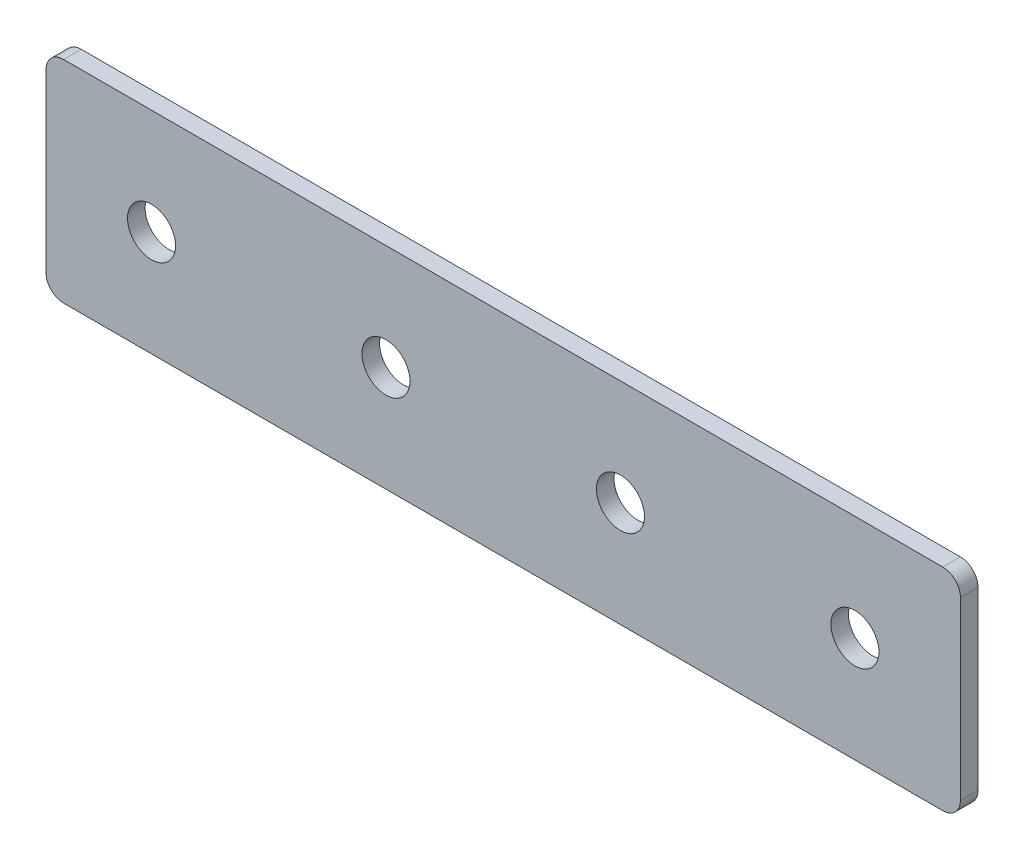
ISO-10303-21;
HEADER;
FILE_DESCRIPTION(('STEP AP214'),'2;1');
FILE_NAME('part.step','',(''),(''),'','','');
FILE_SCHEMA(('AUTOMOTIVE_DESIGN { 1 0 10303 214 1 1 1 1 }'));
ENDSEC;
DATA;
#1=APPLICATION_CONTEXT('core data for automotive mechanical design processes');
#2=APPLICATION_PROTOCOL_DEFINITION('international standard','automotive_design',2000,#1);
#3=PRODUCT_CONTEXT('',#1,'mechanical');
#4=PRODUCT('Part','Part','',(#3));
#5=PRODUCT_RELATED_PRODUCT_CATEGORY('part','',(#4));
#6=PRODUCT_DEFINITION_FORMATION('','',#4);
#7=PRODUCT_DEFINITION_CONTEXT('part definition',#1,'design');
#8=PRODUCT_DEFINITION('design','',#6,#7);
#9=PRODUCT_DEFINITION_SHAPE('','',#8);
#10=(LENGTH_UNIT() NAMED_UNIT(*) SI_UNIT(.MILLI.,.METRE.));
#11=(NAMED_UNIT(*) PLANE_ANGLE_UNIT() SI_UNIT($,.RADIAN.));
#12=(NAMED_UNIT(*) SI_UNIT($,.STERADIAN.) SOLID_ANGLE_UNIT());
#13=UNCERTAINTY_MEASURE_WITH_UNIT(LENGTH_MEASURE(1.E-05),#10,'distance_accuracy_value','');
#14=(GEOMETRIC_REPRESENTATION_CONTEXT(3) GLOBAL_UNCERTAINTY_ASSIGNED_CONTEXT((#13)) GLOBAL_UNIT_ASSIGNED_CONTEXT((#10,
#11,#12)) REPRESENTATION_CONTEXT('',''));
#15=CARTESIAN_POINT('',(0.,0.,0.));
#16=DIRECTION('',(0.,0.,1.));
#17=DIRECTION('',(1.,0.,0.));
#18=AXIS2_PLACEMENT_3D('',#15,#16,#17);
#19=CARTESIAN_POINT('',(0.,0.,3.));
#20=DIRECTION('',(0.,0.,-1.));
#21=DIRECTION('',(-1.,0.,0.));
#22=AXIS2_PLACEMENT_3D('',#19,#20,#21);
#23=PLANE('',#22);
#24=CARTESIAN_POINT('',(120.,0.,3.));
#25=DIRECTION('',(0.,0.,1.));
#26=DIRECTION('',(1.,0.,0.));
#27=AXIS2_PLACEMENT_3D('',#24,#25,#26);
#28=CIRCLE('',#27,4.1);
#29=CARTESIAN_POINT('',(124.1,0.,3.));
#30=VERTEX_POINT('',#29);
#31=EDGE_CURVE('E154',#30,#30,#28,.T.);
#32=ORIENTED_EDGE('',*,*,#31,.F.);
#33=EDGE_LOOP('',(#32));
#34=FACE_BOUND('',#33,.T.);
#35=CARTESIAN_POINT('',(80.,0.,3.));
#36=DIRECTION('',(0.,0.,1.));
#37=DIRECTION('',(1.,0.,0.));
#38=AXIS2_PLACEMENT_3D('',#35,#36,#37);
#39=CIRCLE('',#38,4.1);
#40=CARTESIAN_POINT('',(84.1,0.,3.));
#41=VERTEX_POINT('',#40);
#42=EDGE_CURVE('E160',#41,#41,#39,.T.);
#43=ORIENTED_EDGE('',*,*,#42,.F.);
#44=EDGE_LOOP('',(#43));
#45=FACE_BOUND('',#44,.T.);
#46=CARTESIAN_POINT('',(40.,0.,3.));
#47=DIRECTION('',(0.,0.,1.));
#48=DIRECTION('',(1.,0.,0.));
#49=AXIS2_PLACEMENT_3D('',#46,#47,#48);
#50=CIRCLE('',#49,4.1);
#51=CARTESIAN_POINT('',(44.1,0.,3.));
#52=VERTEX_POINT('',#51);
#53=EDGE_CURVE('E166',#52,#52,#50,.T.);
#54=ORIENTED_EDGE('',*,*,#53,.F.);
#55=EDGE_LOOP('',(#54));
#56=FACE_BOUND('',#55,.T.);
#57=CARTESIAN_POINT('',(0.,0.,3.));
#58=DIRECTION('',(0.,0.,1.));
#59=DIRECTION('',(1.,0.,0.));
#60=AXIS2_PLACEMENT_3D('',#57,#58,#59);
#61=CIRCLE('',#60,4.1);
#62=CARTESIAN_POINT('',(4.1,0.,3.));
#63=VERTEX_POINT('',#62);
#64=EDGE_CURVE('E107',#63,#63,#61,.T.);
#65=ORIENTED_EDGE('',*,*,#64,.F.);
#66=EDGE_LOOP('',(#65));
#67=FACE_BOUND('',#66,.T.);
#68=DIRECTION('',(1.,0.,0.));
#69=VECTOR('',#68,1.);
#70=CARTESIAN_POINT('',(-18.,-18.,3.));
#71=LINE('',#70,#69);
#72=CARTESIAN_POINT('',(-15.,-18.,3.));
#73=VERTEX_POINT('',#72);
#74=CARTESIAN_POINT('',(135.,-18.,3.));
#75=VERTEX_POINT('',#74);
#76=EDGE_CURVE('E84',#73,#75,#71,.T.);
#77=ORIENTED_EDGE('',*,*,#76,.T.);
#78=CARTESIAN_POINT('',(135.,-15.,3.));
#79=DIRECTION('',(0.,0.,-1.));
#80=DIRECTION('',(-1.,0.,0.));
#81=AXIS2_PLACEMENT_3D('',#78,#79,#80);
#82=CIRCLE('',#81,3.);
#83=CARTESIAN_POINT('',(138.,-15.,3.));
#84=VERTEX_POINT('',#83);
#85=EDGE_CURVE('E91',#75,#84,#82,.F.);
#86=ORIENTED_EDGE('',*,*,#85,.T.);
#87=DIRECTION('',(0.,1.,0.));
#88=VECTOR('',#87,1.);
#89=CARTESIAN_POINT('',(138.,-18.,3.));
#90=LINE('',#89,#88);
#91=CARTESIAN_POINT('',(138.,15.,3.));
#92=VERTEX_POINT('',#91);
#93=EDGE_CURVE('E102',#84,#92,#90,.T.);
#94=ORIENTED_EDGE('',*,*,#93,.T.);
#95=CARTESIAN_POINT('',(135.,15.,3.));
#96=DIRECTION('',(0.,0.,-1.));
#97=DIRECTION('',(-1.,0.,0.));
#98=AXIS2_PLACEMENT_3D('',#95,#96,#97);
#99=CIRCLE('',#98,3.);
#100=CARTESIAN_POINT('',(135.,18.,3.));
#101=VERTEX_POINT('',#100);
#102=EDGE_CURVE('E109',#92,#101,#99,.F.);
#103=ORIENTED_EDGE('',*,*,#102,.T.);
#104=DIRECTION('',(-1.,0.,0.));
#105=VECTOR('',#104,1.);
#106=CARTESIAN_POINT('',(138.,18.,3.));
#107=LINE('',#106,#105);
#108=CARTESIAN_POINT('',(-15.,18.,3.));
#109=VERTEX_POINT('',#108);
#110=EDGE_CURVE('E139',#101,#109,#107,.T.);
#111=ORIENTED_EDGE('',*,*,#110,.T.);
#112=CARTESIAN_POINT('',(-15.,15.,3.));
#113=DIRECTION('',(0.,0.,-1.));
#114=DIRECTION('',(-1.,0.,0.));
#115=AXIS2_PLACEMENT_3D('',#112,#113,#114);
#116=CIRCLE('',#115,3.);
#117=CARTESIAN_POINT('',(-18.,15.,3.));
#118=VERTEX_POINT('',#117);
#119=EDGE_CURVE('E92',#109,#118,#116,.F.);
#120=ORIENTED_EDGE('',*,*,#119,.T.);
#121=DIRECTION('',(0.,-1.,0.));
#122=VECTOR('',#121,1.);
#123=CARTESIAN_POINT('',(-18.,18.,3.));
#124=LINE('',#123,#122);
#125=CARTESIAN_POINT('',(-18.,-15.,3.));
#126=VERTEX_POINT('',#125);
#127=EDGE_CURVE('E86',#118,#126,#124,.T.);
#128=ORIENTED_EDGE('',*,*,#127,.T.);
#129=CARTESIAN_POINT('',(-15.,-15.,3.));
#130=DIRECTION('',(0.,0.,-1.));
#131=DIRECTION('',(-1.,0.,0.));
#132=AXIS2_PLACEMENT_3D('',#129,#130,#131);
#133=CIRCLE('',#132,3.);
#134=EDGE_CURVE('E82',#126,#73,#133,.F.);
#135=ORIENTED_EDGE('',*,*,#134,.T.);
#136=EDGE_LOOP('',(#77,#86,#94,#103,#111,#120,#128,#135));
#137=FACE_BOUND('',#136,.T.);
#138=ADVANCED_FACE('F16',(#34,#45,#56,#67,#137),#23,.F.);
#139=CARTESIAN_POINT('',(0.,0.,0.));
#140=DIRECTION('',(0.,0.,-1.));
#141=DIRECTION('',(-1.,0.,0.));
#142=AXIS2_PLACEMENT_3D('',#139,#140,#141);
#143=PLANE('',#142);
#144=CARTESIAN_POINT('',(120.,0.,0.));
#145=DIRECTION('',(0.,0.,1.));
#146=DIRECTION('',(1.,0.,0.));
#147=AXIS2_PLACEMENT_3D('',#144,#145,#146);
#148=CIRCLE('',#147,4.1);
#149=CARTESIAN_POINT('',(124.1,0.,0.));
#150=VERTEX_POINT('',#149);
#151=EDGE_CURVE('E150',#150,#150,#148,.T.);
#152=ORIENTED_EDGE('',*,*,#151,.T.);
#153=EDGE_LOOP('',(#152));
#154=FACE_BOUND('',#153,.T.);
#155=CARTESIAN_POINT('',(80.,0.,0.));
#156=DIRECTION('',(0.,0.,1.));
#157=DIRECTION('',(1.,0.,0.));
#158=AXIS2_PLACEMENT_3D('',#155,#156,#157);
#159=CIRCLE('',#158,4.1);
#160=CARTESIAN_POINT('',(84.1,0.,0.));
#161=VERTEX_POINT('',#160);
#162=EDGE_CURVE('E157',#161,#161,#159,.T.);
#163=ORIENTED_EDGE('',*,*,#162,.T.);
#164=EDGE_LOOP('',(#163));
#165=FACE_BOUND('',#164,.T.);
#166=CARTESIAN_POINT('',(40.,0.,0.));
#167=DIRECTION('',(0.,0.,1.));
#168=DIRECTION('',(1.,0.,0.));
#169=AXIS2_PLACEMENT_3D('',#166,#167,#168);
#170=CIRCLE('',#169,4.1);
#171=CARTESIAN_POINT('',(44.1,0.,0.));
#172=VERTEX_POINT('',#171);
#173=EDGE_CURVE('E163',#172,#172,#170,.T.);
#174=ORIENTED_EDGE('',*,*,#173,.T.);
#175=EDGE_LOOP('',(#174));
#176=FACE_BOUND('',#175,.T.);
#177=CARTESIAN_POINT('',(0.,0.,0.));
#178=DIRECTION('',(0.,0.,1.));
#179=DIRECTION('',(1.,0.,0.));
#180=AXIS2_PLACEMENT_3D('',#177,#178,#179);
#181=CIRCLE('',#180,4.1);
#182=CARTESIAN_POINT('',(4.1,0.,0.));
#183=VERTEX_POINT('',#182);
#184=EDGE_CURVE('E112',#183,#183,#181,.T.);
#185=ORIENTED_EDGE('',*,*,#184,.T.);
#186=EDGE_LOOP('',(#185));
#187=FACE_BOUND('',#186,.T.);
#188=DIRECTION('',(0.,1.,0.));
#189=VECTOR('',#188,1.);
#190=CARTESIAN_POINT('',(138.,-18.,0.));
#191=LINE('',#190,#189);
#192=CARTESIAN_POINT('',(138.,-15.,0.));
#193=VERTEX_POINT('',#192);
#194=CARTESIAN_POINT('',(138.,15.,0.));
#195=VERTEX_POINT('',#194);
#196=EDGE_CURVE('E141',#193,#195,#191,.T.);
#197=ORIENTED_EDGE('',*,*,#196,.F.);
#198=CARTESIAN_POINT('',(135.,-15.,0.));
#199=DIRECTION('',(0.,0.,-1.));
#200=DIRECTION('',(-1.,0.,0.));
#201=AXIS2_PLACEMENT_3D('',#198,#199,#200);
#202=CIRCLE('',#201,3.);
#203=CARTESIAN_POINT('',(135.,-18.,0.));
#204=VERTEX_POINT('',#203);
#205=EDGE_CURVE('E128',#193,#204,#202,.T.);
#206=ORIENTED_EDGE('',*,*,#205,.T.);
#207=DIRECTION('',(1.,0.,0.));
#208=VECTOR('',#207,1.);
#209=CARTESIAN_POINT('',(-18.,-18.,0.));
#210=LINE('',#209,#208);
#211=CARTESIAN_POINT('',(-15.,-18.,0.));
#212=VERTEX_POINT('',#211);
#213=EDGE_CURVE('E138',#212,#204,#210,.T.);
#214=ORIENTED_EDGE('',*,*,#213,.F.);
#215=CARTESIAN_POINT('',(-15.,-15.,0.));
#216=DIRECTION('',(0.,0.,-1.));
#217=DIRECTION('',(-1.,0.,0.));
#218=AXIS2_PLACEMENT_3D('',#215,#216,#217);
#219=CIRCLE('',#218,3.);
#220=CARTESIAN_POINT('',(-18.,-15.,0.));
#221=VERTEX_POINT('',#220);
#222=EDGE_CURVE('E106',#212,#221,#219,.T.);
#223=ORIENTED_EDGE('',*,*,#222,.T.);
#224=DIRECTION('',(0.,-1.,0.));
#225=VECTOR('',#224,1.);
#226=CARTESIAN_POINT('',(-18.,18.,0.));
#227=LINE('',#226,#225);
#228=CARTESIAN_POINT('',(-18.,15.,0.));
#229=VERTEX_POINT('',#228);
#230=EDGE_CURVE('E137',#229,#221,#227,.T.);
#231=ORIENTED_EDGE('',*,*,#230,.F.);
#232=CARTESIAN_POINT('',(-15.,15.,0.));
#233=DIRECTION('',(0.,0.,-1.));
#234=DIRECTION('',(-1.,0.,0.));
#235=AXIS2_PLACEMENT_3D('',#232,#233,#234);
#236=CIRCLE('',#235,3.);
#237=CARTESIAN_POINT('',(-15.,18.,0.));
#238=VERTEX_POINT('',#237);
#239=EDGE_CURVE('E31',#229,#238,#236,.T.);
#240=ORIENTED_EDGE('',*,*,#239,.T.);
#241=DIRECTION('',(-1.,0.,0.));
#242=VECTOR('',#241,1.);
#243=CARTESIAN_POINT('',(138.,18.,0.));
#244=LINE('',#243,#242);
#245=CARTESIAN_POINT('',(135.,18.,0.));
#246=VERTEX_POINT('',#245);
#247=EDGE_CURVE('E148',#246,#238,#244,.T.);
#248=ORIENTED_EDGE('',*,*,#247,.F.);
#249=CARTESIAN_POINT('',(135.,15.,0.));
#250=DIRECTION('',(0.,0.,-1.));
#251=DIRECTION('',(-1.,0.,0.));
#252=AXIS2_PLACEMENT_3D('',#249,#250,#251);
#253=CIRCLE('',#252,3.);
#254=EDGE_CURVE('E124',#246,#195,#253,.T.);
#255=ORIENTED_EDGE('',*,*,#254,.T.);
#256=EDGE_LOOP('',(#197,#206,#214,#223,#231,#240,#248,#255));
#257=FACE_BOUND('',#256,.T.);
#258=ADVANCED_FACE('F172',(#154,#165,#176,#187,#257),#143,.T.);
#259=CARTESIAN_POINT('',(0.,0.,3.));
#260=DIRECTION('',(0.,0.,-1.));
#261=DIRECTION('',(-1.,0.,0.));
#262=AXIS2_PLACEMENT_3D('',#259,#260,#261);
#263=CYLINDRICAL_SURFACE('',#262,4.1);
#264=ORIENTED_EDGE('',*,*,#64,.T.);
#265=EDGE_LOOP('',(#264));
#266=FACE_BOUND('',#265,.T.);
#267=ORIENTED_EDGE('',*,*,#184,.F.);
#268=EDGE_LOOP('',(#267));
#269=FACE_BOUND('',#268,.T.);
#270=ADVANCED_FACE('F178',(#266,#269),#263,.F.);
#271=CARTESIAN_POINT('',(40.,0.,3.));
#272=DIRECTION('',(0.,0.,-1.));
#273=DIRECTION('',(-1.,0.,0.));
#274=AXIS2_PLACEMENT_3D('',#271,#272,#273);
#275=CYLINDRICAL_SURFACE('',#274,4.1);
#276=ORIENTED_EDGE('',*,*,#53,.T.);
#277=EDGE_LOOP('',(#276));
#278=FACE_BOUND('',#277,.T.);
#279=ORIENTED_EDGE('',*,*,#173,.F.);
#280=EDGE_LOOP('',(#279));
#281=FACE_BOUND('',#280,.T.);
#282=ADVANCED_FACE('F175',(#278,#281),#275,.F.);
#283=CARTESIAN_POINT('',(80.,0.,3.));
#284=DIRECTION('',(0.,0.,-1.));
#285=DIRECTION('',(-1.,0.,0.));
#286=AXIS2_PLACEMENT_3D('',#283,#284,#285);
#287=CYLINDRICAL_SURFACE('',#286,4.1);
#288=ORIENTED_EDGE('',*,*,#42,.T.);
#289=EDGE_LOOP('',(#288));
#290=FACE_BOUND('',#289,.T.);
#291=ORIENTED_EDGE('',*,*,#162,.F.);
#292=EDGE_LOOP('',(#291));
#293=FACE_BOUND('',#292,.T.);
#294=ADVANCED_FACE('F177',(#290,#293),#287,.F.);
#295=CARTESIAN_POINT('',(120.,0.,3.));
#296=DIRECTION('',(0.,0.,-1.));
#297=DIRECTION('',(-1.,0.,0.));
#298=AXIS2_PLACEMENT_3D('',#295,#296,#297);
#299=CYLINDRICAL_SURFACE('',#298,4.1);
#300=ORIENTED_EDGE('',*,*,#31,.T.);
#301=EDGE_LOOP('',(#300));
#302=FACE_BOUND('',#301,.T.);
#303=ORIENTED_EDGE('',*,*,#151,.F.);
#304=EDGE_LOOP('',(#303));
#305=FACE_BOUND('',#304,.T.);
#306=ADVANCED_FACE('F186',(#302,#305),#299,.F.);
#307=CARTESIAN_POINT('',(-18.,18.,0.));
#308=DIRECTION('',(-1.,0.,0.));
#309=DIRECTION('',(0.,0.,1.));
#310=AXIS2_PLACEMENT_3D('',#307,#308,#309);
#311=PLANE('',#310);
#312=ORIENTED_EDGE('',*,*,#230,.T.);
#313=DIRECTION('',(0.,0.,1.));
#314=VECTOR('',#313,1.);
#315=CARTESIAN_POINT('',(-18.,-15.,0.));
#316=LINE('',#315,#314);
#317=EDGE_CURVE('E132',#221,#126,#316,.T.);
#318=ORIENTED_EDGE('',*,*,#317,.T.);
#319=ORIENTED_EDGE('',*,*,#127,.F.);
#320=DIRECTION('',(0.,0.,1.));
#321=VECTOR('',#320,1.);
#322=CARTESIAN_POINT('',(-18.,15.,0.));
#323=LINE('',#322,#321);
#324=EDGE_CURVE('E130',#118,#229,#323,.F.);
#325=ORIENTED_EDGE('',*,*,#324,.T.);
#326=EDGE_LOOP('',(#312,#318,#319,#325));
#327=FACE_BOUND('',#326,.T.);
#328=ADVANCED_FACE('F135',(#327),#311,.T.);
#329=CARTESIAN_POINT('',(138.,18.,0.));
#330=DIRECTION('',(0.,1.,0.));
#331=DIRECTION('',(0.,0.,1.));
#332=AXIS2_PLACEMENT_3D('',#329,#330,#331);
#333=PLANE('',#332);
#334=ORIENTED_EDGE('',*,*,#247,.T.);
#335=DIRECTION('',(0.,0.,1.));
#336=VECTOR('',#335,1.);
#337=CARTESIAN_POINT('',(-15.,18.,0.));
#338=LINE('',#337,#336);
#339=EDGE_CURVE('E10',#238,#109,#338,.T.);
#340=ORIENTED_EDGE('',*,*,#339,.T.);
#341=ORIENTED_EDGE('',*,*,#110,.F.);
#342=DIRECTION('',(0.,0.,1.));
#343=VECTOR('',#342,1.);
#344=CARTESIAN_POINT('',(135.,18.,0.));
#345=LINE('',#344,#343);
#346=EDGE_CURVE('E24',#101,#246,#345,.F.);
#347=ORIENTED_EDGE('',*,*,#346,.T.);
#348=EDGE_LOOP('',(#334,#340,#341,#347));
#349=FACE_BOUND('',#348,.T.);
#350=ADVANCED_FACE('F215',(#349),#333,.T.);
#351=CARTESIAN_POINT('',(138.,-18.,0.));
#352=DIRECTION('',(1.,0.,0.));
#353=DIRECTION('',(0.,0.,-1.));
#354=AXIS2_PLACEMENT_3D('',#351,#352,#353);
#355=PLANE('',#354);
#356=ORIENTED_EDGE('',*,*,#93,.F.);
#357=DIRECTION('',(0.,0.,1.));
#358=VECTOR('',#357,1.);
#359=CARTESIAN_POINT('',(138.,-15.,0.));
#360=LINE('',#359,#358);
#361=EDGE_CURVE('E122',#84,#193,#360,.F.);
#362=ORIENTED_EDGE('',*,*,#361,.T.);
#363=ORIENTED_EDGE('',*,*,#196,.T.);
#364=DIRECTION('',(0.,0.,1.));
#365=VECTOR('',#364,1.);
#366=CARTESIAN_POINT('',(138.,15.,0.));
#367=LINE('',#366,#365);
#368=EDGE_CURVE('E119',#195,#92,#367,.T.);
#369=ORIENTED_EDGE('',*,*,#368,.T.);
#370=EDGE_LOOP('',(#356,#362,#363,#369));
#371=FACE_BOUND('',#370,.T.);
#372=ADVANCED_FACE('F220',(#371),#355,.T.);
#373=CARTESIAN_POINT('',(-18.,-18.,0.));
#374=DIRECTION('',(0.,-1.,0.));
#375=DIRECTION('',(0.,0.,-1.));
#376=AXIS2_PLACEMENT_3D('',#373,#374,#375);
#377=PLANE('',#376);
#378=ORIENTED_EDGE('',*,*,#213,.T.);
#379=DIRECTION('',(0.,0.,1.));
#380=VECTOR('',#379,1.);
#381=CARTESIAN_POINT('',(135.,-18.,0.));
#382=LINE('',#381,#380);
#383=EDGE_CURVE('E101',#204,#75,#382,.T.);
#384=ORIENTED_EDGE('',*,*,#383,.T.);
#385=ORIENTED_EDGE('',*,*,#76,.F.);
#386=DIRECTION('',(0.,0.,1.));
#387=VECTOR('',#386,1.);
#388=CARTESIAN_POINT('',(-15.,-18.,0.));
#389=LINE('',#388,#387);
#390=EDGE_CURVE('E98',#73,#212,#389,.F.);
#391=ORIENTED_EDGE('',*,*,#390,.T.);
#392=EDGE_LOOP('',(#378,#384,#385,#391));
#393=FACE_BOUND('',#392,.T.);
#394=ADVANCED_FACE('F97',(#393),#377,.T.);
#395=CARTESIAN_POINT('',(135.,-15.,0.));
#396=DIRECTION('',(0.,0.,1.));
#397=DIRECTION('',(1.,0.,0.));
#398=AXIS2_PLACEMENT_3D('',#395,#396,#397);
#399=CYLINDRICAL_SURFACE('',#398,3.);
#400=ORIENTED_EDGE('',*,*,#205,.F.);
#401=ORIENTED_EDGE('',*,*,#361,.F.);
#402=ORIENTED_EDGE('',*,*,#85,.F.);
#403=ORIENTED_EDGE('',*,*,#383,.F.);
#404=EDGE_LOOP('',(#400,#401,#402,#403));
#405=FACE_BOUND('',#404,.T.);
#406=ADVANCED_FACE('F202',(#405),#399,.T.);
#407=CARTESIAN_POINT('',(-15.,-15.,0.));
#408=DIRECTION('',(0.,0.,1.));
#409=DIRECTION('',(1.,0.,0.));
#410=AXIS2_PLACEMENT_3D('',#407,#408,#409);
#411=CYLINDRICAL_SURFACE('',#410,3.);
#412=ORIENTED_EDGE('',*,*,#222,.F.);
#413=ORIENTED_EDGE('',*,*,#390,.F.);
#414=ORIENTED_EDGE('',*,*,#134,.F.);
#415=ORIENTED_EDGE('',*,*,#317,.F.);
#416=EDGE_LOOP('',(#412,#413,#414,#415));
#417=FACE_BOUND('',#416,.T.);
#418=ADVANCED_FACE('F105',(#417),#411,.T.);
#419=CARTESIAN_POINT('',(-15.,15.,0.));
#420=DIRECTION('',(0.,0.,1.));
#421=DIRECTION('',(1.,0.,0.));
#422=AXIS2_PLACEMENT_3D('',#419,#420,#421);
#423=CYLINDRICAL_SURFACE('',#422,3.);
#424=ORIENTED_EDGE('',*,*,#239,.F.);
#425=ORIENTED_EDGE('',*,*,#324,.F.);
#426=ORIENTED_EDGE('',*,*,#119,.F.);
#427=ORIENTED_EDGE('',*,*,#339,.F.);
#428=EDGE_LOOP('',(#424,#425,#426,#427));
#429=FACE_BOUND('',#428,.T.);
#430=ADVANCED_FACE('F207',(#429),#423,.T.);
#431=CARTESIAN_POINT('',(135.,15.,0.));
#432=DIRECTION('',(0.,0.,1.));
#433=DIRECTION('',(1.,0.,0.));
#434=AXIS2_PLACEMENT_3D('',#431,#432,#433);
#435=CYLINDRICAL_SURFACE('',#434,3.);
#436=ORIENTED_EDGE('',*,*,#254,.F.);
#437=ORIENTED_EDGE('',*,*,#346,.F.);
#438=ORIENTED_EDGE('',*,*,#102,.F.);
#439=ORIENTED_EDGE('',*,*,#368,.F.);
#440=EDGE_LOOP('',(#436,#437,#438,#439));
#441=FACE_BOUND('',#440,.T.);
#442=ADVANCED_FACE('F18',(#441),#435,.T.);
#443=CLOSED_SHELL('',(#138,#258,#270,#282,#294,#306,#328,#350,#372,#394,#406,#418,#430,#442));
#444=MANIFOLD_SOLID_BREP('B1',#443);
#445=ADVANCED_BREP_SHAPE_REPRESENTATION('',(#18,#444),#14);
#446=SHAPE_DEFINITION_REPRESENTATION(#9,#445);
ENDSEC;
END-ISO-10303-21;
